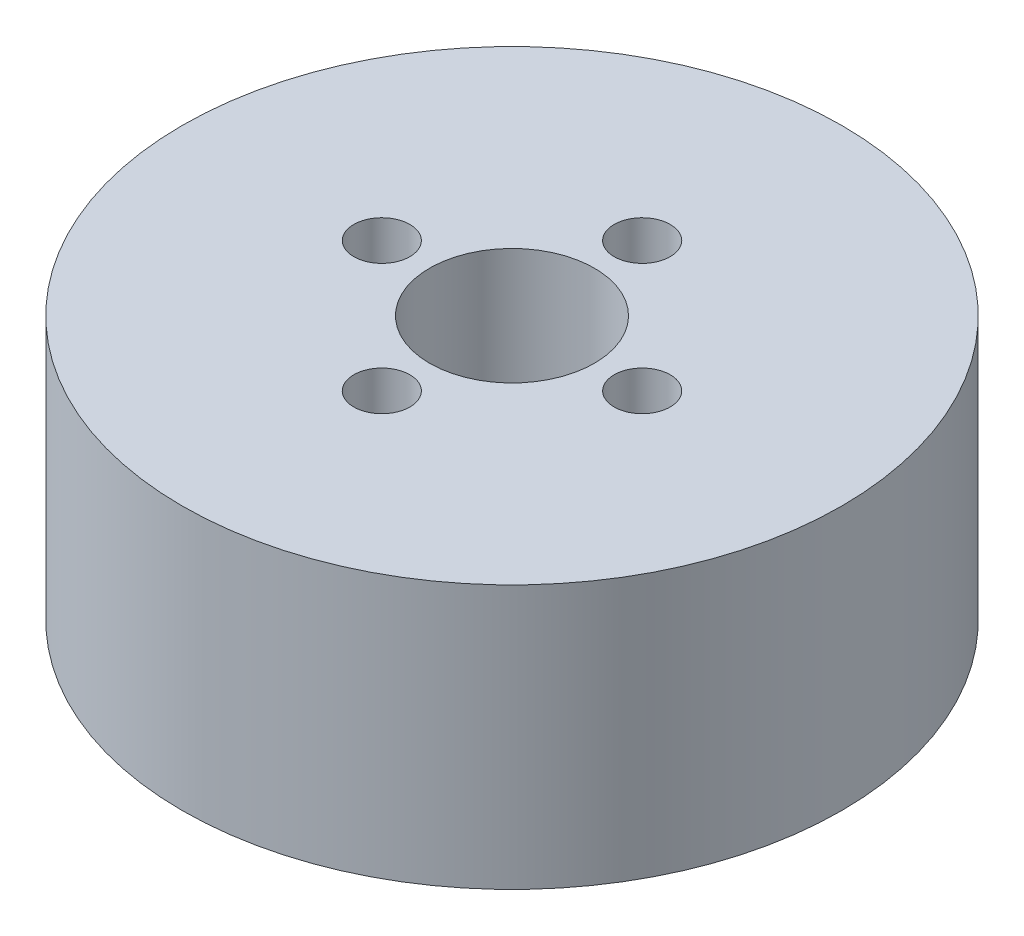
ISO-10303-21;
HEADER;
FILE_DESCRIPTION(('STEP AP214'),'2;1');
FILE_NAME('part.step','',(''),(''),'','','');
FILE_SCHEMA(('AUTOMOTIVE_DESIGN { 1 0 10303 214 1 1 1 1 }'));
ENDSEC;
DATA;
#1=APPLICATION_CONTEXT('core data for automotive mechanical design processes');
#2=APPLICATION_PROTOCOL_DEFINITION('international standard','automotive_design',2000,#1);
#3=PRODUCT_CONTEXT('',#1,'mechanical');
#4=PRODUCT('Part','Part','',(#3));
#5=PRODUCT_RELATED_PRODUCT_CATEGORY('part','',(#4));
#6=PRODUCT_DEFINITION_FORMATION('','',#4);
#7=PRODUCT_DEFINITION_CONTEXT('part definition',#1,'design');
#8=PRODUCT_DEFINITION('design','',#6,#7);
#9=PRODUCT_DEFINITION_SHAPE('','',#8);
#10=(LENGTH_UNIT() NAMED_UNIT(*) SI_UNIT(.MILLI.,.METRE.));
#11=(NAMED_UNIT(*) PLANE_ANGLE_UNIT() SI_UNIT($,.RADIAN.));
#12=(NAMED_UNIT(*) SI_UNIT($,.STERADIAN.) SOLID_ANGLE_UNIT());
#13=UNCERTAINTY_MEASURE_WITH_UNIT(LENGTH_MEASURE(1.E-05),#10,'distance_accuracy_value','');
#14=(GEOMETRIC_REPRESENTATION_CONTEXT(3) GLOBAL_UNCERTAINTY_ASSIGNED_CONTEXT((#13)) GLOBAL_UNIT_ASSIGNED_CONTEXT((#10,
#11,#12)) REPRESENTATION_CONTEXT('',''));
#15=CARTESIAN_POINT('',(0.,0.,0.));
#16=DIRECTION('',(0.,0.,1.));
#17=DIRECTION('',(1.,0.,0.));
#18=AXIS2_PLACEMENT_3D('',#15,#16,#17);
#19=CARTESIAN_POINT('',(0.,16.,0.));
#20=DIRECTION('',(0.,-1.,0.));
#21=DIRECTION('',(0.,0.,-1.));
#22=AXIS2_PLACEMENT_3D('',#19,#20,#21);
#23=CYLINDRICAL_SURFACE('',#22,20.);
#24=CARTESIAN_POINT('',(0.,16.,0.));
#25=DIRECTION('',(0.,1.,0.));
#26=DIRECTION('',(0.,0.,1.));
#27=AXIS2_PLACEMENT_3D('',#24,#25,#26);
#28=CIRCLE('',#27,20.);
#29=CARTESIAN_POINT('',(0.,16.,20.));
#30=VERTEX_POINT('',#29);
#31=EDGE_CURVE('E10',#30,#30,#28,.T.);
#32=ORIENTED_EDGE('',*,*,#31,.F.);
#33=EDGE_LOOP('',(#32));
#34=FACE_BOUND('',#33,.T.);
#35=CARTESIAN_POINT('',(0.,0.,0.));
#36=DIRECTION('',(0.,1.,0.));
#37=DIRECTION('',(0.,0.,1.));
#38=AXIS2_PLACEMENT_3D('',#35,#36,#37);
#39=CIRCLE('',#38,20.);
#40=CARTESIAN_POINT('',(0.,0.,20.));
#41=VERTEX_POINT('',#40);
#42=EDGE_CURVE('E37',#41,#41,#39,.T.);
#43=ORIENTED_EDGE('',*,*,#42,.T.);
#44=EDGE_LOOP('',(#43));
#45=FACE_BOUND('',#44,.T.);
#46=ADVANCED_FACE('F40',(#34,#45),#23,.T.);
#47=CARTESIAN_POINT('',(0.,16.,0.));
#48=DIRECTION('',(0.,1.,0.));
#49=DIRECTION('',(0.,0.,1.));
#50=AXIS2_PLACEMENT_3D('',#47,#48,#49);
#51=PLANE('',#50);
#52=CARTESIAN_POINT('',(0.,16.,7.89652670494721));
#53=DIRECTION('',(0.,1.,0.));
#54=DIRECTION('',(1.,0.,0.));
#55=AXIS2_PLACEMENT_3D('',#52,#53,#54);
#56=CIRCLE('',#55,1.69818000125749);
#57=CARTESIAN_POINT('',(1.69818000125752,16.,7.8965267049472));
#58=VERTEX_POINT('',#57);
#59=EDGE_CURVE('E71',#58,#58,#56,.T.);
#60=ORIENTED_EDGE('',*,*,#59,.F.);
#61=EDGE_LOOP('',(#60));
#62=FACE_BOUND('',#61,.T.);
#63=CARTESIAN_POINT('',(7.89652670494721,16.,0.));
#64=DIRECTION('',(0.,1.,0.));
#65=DIRECTION('',(0.,0.,-1.));
#66=AXIS2_PLACEMENT_3D('',#63,#64,#65);
#67=CIRCLE('',#66,1.69818000125749);
#68=CARTESIAN_POINT('',(7.89652670494721,16.,-1.69818000125749));
#69=VERTEX_POINT('',#68);
#70=EDGE_CURVE('E70',#69,#69,#67,.T.);
#71=ORIENTED_EDGE('',*,*,#70,.F.);
#72=EDGE_LOOP('',(#71));
#73=FACE_BOUND('',#72,.T.);
#74=CARTESIAN_POINT('',(0.,16.,-7.89652670494721));
#75=DIRECTION('',(0.,1.,0.));
#76=DIRECTION('',(-1.,0.,0.));
#77=AXIS2_PLACEMENT_3D('',#74,#75,#76);
#78=CIRCLE('',#77,1.69818000125749);
#79=CARTESIAN_POINT('',(-1.69818000125758,16.,-7.89652670494719));
#80=VERTEX_POINT('',#79);
#81=EDGE_CURVE('E61',#80,#80,#78,.T.);
#82=ORIENTED_EDGE('',*,*,#81,.F.);
#83=EDGE_LOOP('',(#82));
#84=FACE_BOUND('',#83,.T.);
#85=CARTESIAN_POINT('',(-7.89652670494721,16.,0.));
#86=DIRECTION('',(0.,1.,0.));
#87=DIRECTION('',(0.,0.,1.));
#88=AXIS2_PLACEMENT_3D('',#85,#86,#87);
#89=CIRCLE('',#88,1.69818000125749);
#90=CARTESIAN_POINT('',(-7.89652670494721,16.,1.69818000125749));
#91=VERTEX_POINT('',#90);
#92=EDGE_CURVE('E54',#91,#91,#89,.T.);
#93=ORIENTED_EDGE('',*,*,#92,.F.);
#94=EDGE_LOOP('',(#93));
#95=FACE_BOUND('',#94,.T.);
#96=CARTESIAN_POINT('',(0.,16.,0.));
#97=DIRECTION('',(0.,1.,0.));
#98=DIRECTION('',(0.,0.,1.));
#99=AXIS2_PLACEMENT_3D('',#96,#97,#98);
#100=CIRCLE('',#99,5.);
#101=CARTESIAN_POINT('',(0.,16.,5.));
#102=VERTEX_POINT('',#101);
#103=EDGE_CURVE('E50',#102,#102,#100,.T.);
#104=ORIENTED_EDGE('',*,*,#103,.F.);
#105=EDGE_LOOP('',(#104));
#106=FACE_BOUND('',#105,.T.);
#107=ORIENTED_EDGE('',*,*,#31,.T.);
#108=EDGE_LOOP('',(#107));
#109=FACE_BOUND('',#108,.T.);
#110=ADVANCED_FACE('F86',(#62,#73,#84,#95,#106,#109),#51,.T.);
#111=CARTESIAN_POINT('',(0.,0.,0.));
#112=DIRECTION('',(0.,1.,0.));
#113=DIRECTION('',(0.,0.,1.));
#114=AXIS2_PLACEMENT_3D('',#111,#112,#113);
#115=PLANE('',#114);
#116=CARTESIAN_POINT('',(0.,0.,0.));
#117=DIRECTION('',(0.,1.,0.));
#118=DIRECTION('',(0.,0.,1.));
#119=AXIS2_PLACEMENT_3D('',#116,#117,#118);
#120=CIRCLE('',#119,5.);
#121=CARTESIAN_POINT('',(0.,0.,5.));
#122=VERTEX_POINT('',#121);
#123=EDGE_CURVE('E47',#122,#122,#120,.T.);
#124=ORIENTED_EDGE('',*,*,#123,.T.);
#125=EDGE_LOOP('',(#124));
#126=FACE_BOUND('',#125,.T.);
#127=ORIENTED_EDGE('',*,*,#42,.F.);
#128=EDGE_LOOP('',(#127));
#129=FACE_BOUND('',#128,.T.);
#130=ADVANCED_FACE('F93',(#126,#129),#115,.F.);
#131=CARTESIAN_POINT('',(0.,16.,0.));
#132=DIRECTION('',(0.,-1.,0.));
#133=DIRECTION('',(0.,0.,-1.));
#134=AXIS2_PLACEMENT_3D('',#131,#132,#133);
#135=CYLINDRICAL_SURFACE('',#134,5.);
#136=ORIENTED_EDGE('',*,*,#103,.T.);
#137=EDGE_LOOP('',(#136));
#138=FACE_BOUND('',#137,.T.);
#139=ORIENTED_EDGE('',*,*,#123,.F.);
#140=EDGE_LOOP('',(#139));
#141=FACE_BOUND('',#140,.T.);
#142=ADVANCED_FACE('F101',(#138,#141),#135,.F.);
#143=CARTESIAN_POINT('',(-7.89652670494721,3.57480509767659,0.));
#144=DIRECTION('',(0.,1.,0.));
#145=DIRECTION('',(0.,0.,1.));
#146=AXIS2_PLACEMENT_3D('',#143,#144,#145);
#147=CYLINDRICAL_SURFACE('',#146,1.69818000125749);
#148=CARTESIAN_POINT('',(-7.89652670494721,3.57480509767659,0.));
#149=DIRECTION('',(0.,1.,0.));
#150=DIRECTION('',(0.,0.,1.));
#151=AXIS2_PLACEMENT_3D('',#148,#149,#150);
#152=CIRCLE('',#151,1.69818000125749);
#153=CARTESIAN_POINT('',(-7.89652670494721,3.57480509767659,1.69818000125749));
#154=VERTEX_POINT('',#153);
#155=EDGE_CURVE('E55',#154,#154,#152,.T.);
#156=ORIENTED_EDGE('',*,*,#155,.F.);
#157=EDGE_LOOP('',(#156));
#158=FACE_BOUND('',#157,.T.);
#159=ORIENTED_EDGE('',*,*,#92,.T.);
#160=EDGE_LOOP('',(#159));
#161=FACE_BOUND('',#160,.T.);
#162=ADVANCED_FACE('F102',(#158,#161),#147,.F.);
#163=CARTESIAN_POINT('',(-7.89652670494721,3.57480509767659,0.));
#164=DIRECTION('',(0.,1.,0.));
#165=DIRECTION('',(0.,0.,1.));
#166=AXIS2_PLACEMENT_3D('',#163,#164,#165);
#167=PLANE('',#166);
#168=ORIENTED_EDGE('',*,*,#155,.T.);
#169=EDGE_LOOP('',(#168));
#170=FACE_BOUND('',#169,.T.);
#171=ADVANCED_FACE('F133',(#170),#167,.T.);
#172=CARTESIAN_POINT('',(0.,3.57480509767659,-7.89652670494721));
#173=DIRECTION('',(0.,1.,0.));
#174=DIRECTION('',(0.,0.,1.));
#175=AXIS2_PLACEMENT_3D('',#172,#173,#174);
#176=CYLINDRICAL_SURFACE('',#175,1.69818000125749);
#177=CARTESIAN_POINT('',(0.,3.57480509767659,-7.89652670494721));
#178=DIRECTION('',(0.,1.,0.));
#179=DIRECTION('',(-1.,0.,0.));
#180=AXIS2_PLACEMENT_3D('',#177,#178,#179);
#181=CIRCLE('',#180,1.69818000125749);
#182=CARTESIAN_POINT('',(-1.69818000125758,3.57480509767659,-7.89652670494719));
#183=VERTEX_POINT('',#182);
#184=EDGE_CURVE('E63',#183,#183,#181,.T.);
#185=ORIENTED_EDGE('',*,*,#184,.F.);
#186=EDGE_LOOP('',(#185));
#187=FACE_BOUND('',#186,.T.);
#188=ORIENTED_EDGE('',*,*,#81,.T.);
#189=EDGE_LOOP('',(#188));
#190=FACE_BOUND('',#189,.T.);
#191=ADVANCED_FACE('F142',(#187,#190),#176,.F.);
#192=CARTESIAN_POINT('',(0.,3.57480509767659,-7.89652670494721));
#193=DIRECTION('',(0.,1.,0.));
#194=DIRECTION('',(-1.,0.,0.));
#195=AXIS2_PLACEMENT_3D('',#192,#193,#194);
#196=PLANE('',#195);
#197=ORIENTED_EDGE('',*,*,#184,.T.);
#198=EDGE_LOOP('',(#197));
#199=FACE_BOUND('',#198,.T.);
#200=ADVANCED_FACE('F156',(#199),#196,.T.);
#201=CARTESIAN_POINT('',(7.89652670494721,3.57480509767659,0.));
#202=DIRECTION('',(0.,1.,0.));
#203=DIRECTION('',(0.,0.,1.));
#204=AXIS2_PLACEMENT_3D('',#201,#202,#203);
#205=CYLINDRICAL_SURFACE('',#204,1.69818000125749);
#206=CARTESIAN_POINT('',(7.89652670494721,3.57480509767659,0.));
#207=DIRECTION('',(0.,1.,0.));
#208=DIRECTION('',(0.,0.,-1.));
#209=AXIS2_PLACEMENT_3D('',#206,#207,#208);
#210=CIRCLE('',#209,1.69818000125749);
#211=CARTESIAN_POINT('',(7.89652670494721,3.57480509767659,-1.69818000125749));
#212=VERTEX_POINT('',#211);
#213=EDGE_CURVE('E69',#212,#212,#210,.T.);
#214=ORIENTED_EDGE('',*,*,#213,.F.);
#215=EDGE_LOOP('',(#214));
#216=FACE_BOUND('',#215,.T.);
#217=ORIENTED_EDGE('',*,*,#70,.T.);
#218=EDGE_LOOP('',(#217));
#219=FACE_BOUND('',#218,.T.);
#220=ADVANCED_FACE('F164',(#216,#219),#205,.F.);
#221=CARTESIAN_POINT('',(7.89652670494721,3.57480509767659,0.));
#222=DIRECTION('',(0.,1.,0.));
#223=DIRECTION('',(0.,0.,-1.));
#224=AXIS2_PLACEMENT_3D('',#221,#222,#223);
#225=PLANE('',#224);
#226=ORIENTED_EDGE('',*,*,#213,.T.);
#227=EDGE_LOOP('',(#226));
#228=FACE_BOUND('',#227,.T.);
#229=ADVANCED_FACE('F83',(#228),#225,.T.);
#230=CARTESIAN_POINT('',(0.,3.57480509767659,7.89652670494721));
#231=DIRECTION('',(0.,1.,0.));
#232=DIRECTION('',(0.,0.,1.));
#233=AXIS2_PLACEMENT_3D('',#230,#231,#232);
#234=CYLINDRICAL_SURFACE('',#233,1.69818000125749);
#235=CARTESIAN_POINT('',(0.,3.57480509767659,7.89652670494721));
#236=DIRECTION('',(0.,1.,0.));
#237=DIRECTION('',(1.,0.,0.));
#238=AXIS2_PLACEMENT_3D('',#235,#236,#237);
#239=CIRCLE('',#238,1.69818000125749);
#240=CARTESIAN_POINT('',(1.69818000125752,3.57480509767659,7.8965267049472));
#241=VERTEX_POINT('',#240);
#242=EDGE_CURVE('E59',#241,#241,#239,.T.);
#243=ORIENTED_EDGE('',*,*,#242,.F.);
#244=EDGE_LOOP('',(#243));
#245=FACE_BOUND('',#244,.T.);
#246=ORIENTED_EDGE('',*,*,#59,.T.);
#247=EDGE_LOOP('',(#246));
#248=FACE_BOUND('',#247,.T.);
#249=ADVANCED_FACE('F81',(#245,#248),#234,.F.);
#250=CARTESIAN_POINT('',(0.,3.57480509767659,7.89652670494721));
#251=DIRECTION('',(0.,1.,0.));
#252=DIRECTION('',(1.,0.,0.));
#253=AXIS2_PLACEMENT_3D('',#250,#251,#252);
#254=PLANE('',#253);
#255=ORIENTED_EDGE('',*,*,#242,.T.);
#256=EDGE_LOOP('',(#255));
#257=FACE_BOUND('',#256,.T.);
#258=ADVANCED_FACE('F78',(#257),#254,.T.);
#259=CLOSED_SHELL('',(#46,#110,#130,#142,#162,#171,#191,#200,#220,#229,#249,#258));
#260=MANIFOLD_SOLID_BREP('B2',#259);
#261=ADVANCED_BREP_SHAPE_REPRESENTATION('',(#18,#260),#14);
#262=SHAPE_DEFINITION_REPRESENTATION(#9,#261);
ENDSEC;
END-ISO-10303-21;
